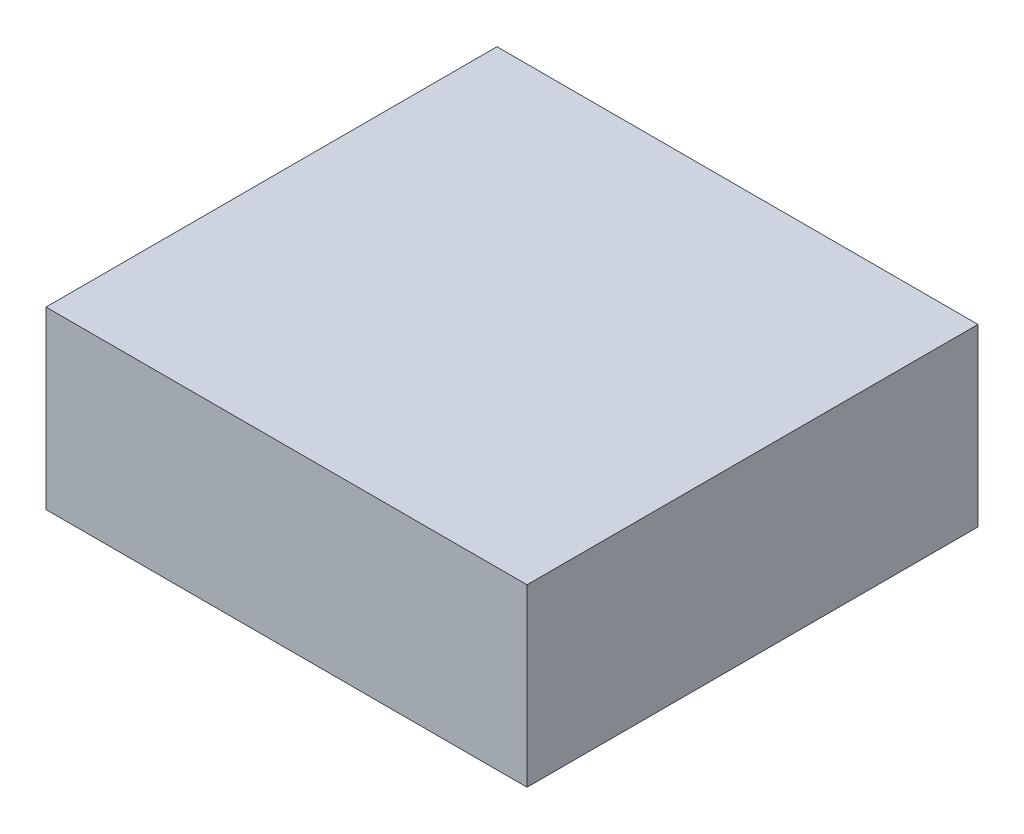
ISO-10303-21;
HEADER;
FILE_DESCRIPTION(('STEP AP214'),'2;1');
FILE_NAME('part.step','',(''),(''),'','','');
FILE_SCHEMA(('AUTOMOTIVE_DESIGN { 1 0 10303 214 1 1 1 1 }'));
ENDSEC;
DATA;
#1=APPLICATION_CONTEXT('core data for automotive mechanical design processes');
#2=APPLICATION_PROTOCOL_DEFINITION('international standard','automotive_design',2000,#1);
#3=PRODUCT_CONTEXT('',#1,'mechanical');
#4=PRODUCT('Part','Part','',(#3));
#5=PRODUCT_RELATED_PRODUCT_CATEGORY('part','',(#4));
#6=PRODUCT_DEFINITION_FORMATION('','',#4);
#7=PRODUCT_DEFINITION_CONTEXT('part definition',#1,'design');
#8=PRODUCT_DEFINITION('design','',#6,#7);
#9=PRODUCT_DEFINITION_SHAPE('','',#8);
#10=(LENGTH_UNIT() NAMED_UNIT(*) SI_UNIT(.MILLI.,.METRE.));
#11=(NAMED_UNIT(*) PLANE_ANGLE_UNIT() SI_UNIT($,.RADIAN.));
#12=(NAMED_UNIT(*) SI_UNIT($,.STERADIAN.) SOLID_ANGLE_UNIT());
#13=UNCERTAINTY_MEASURE_WITH_UNIT(LENGTH_MEASURE(1.E-05),#10,'distance_accuracy_value','');
#14=(GEOMETRIC_REPRESENTATION_CONTEXT(3) GLOBAL_UNCERTAINTY_ASSIGNED_CONTEXT((#13)) GLOBAL_UNIT_ASSIGNED_CONTEXT((#10,
#11,#12)) REPRESENTATION_CONTEXT('',''));
#15=CARTESIAN_POINT('',(0.,0.,0.));
#16=DIRECTION('',(0.,0.,1.));
#17=DIRECTION('',(1.,0.,0.));
#18=AXIS2_PLACEMENT_3D('',#15,#16,#17);
#19=CARTESIAN_POINT('',(-0.47999904,-0.17500092,0.));
#20=DIRECTION('',(0.,1.,0.));
#21=DIRECTION('',(0.,0.,1.));
#22=AXIS2_PLACEMENT_3D('',#19,#20,#21);
#23=PLANE('',#22);
#24=DIRECTION('',(0.,0.,1.));
#25=VECTOR('',#24,1.);
#26=CARTESIAN_POINT('',(0.48000158,-0.17500092,0.));
#27=LINE('',#26,#25);
#28=CARTESIAN_POINT('',(0.48000158,-0.17500092,0.));
#29=VERTEX_POINT('',#28);
#30=CARTESIAN_POINT('',(0.48000158,-0.17500092,0.90000074));
#31=VERTEX_POINT('',#30);
#32=EDGE_CURVE('E19',#29,#31,#27,.T.);
#33=ORIENTED_EDGE('',*,*,#32,.T.);
#34=DIRECTION('',(-1.,0.,0.));
#35=VECTOR('',#34,1.);
#36=CARTESIAN_POINT('',(0.48000158,-0.17500092,0.90000074));
#37=LINE('',#36,#35);
#38=CARTESIAN_POINT('',(-0.47999904,-0.17500092,0.90000074));
#39=VERTEX_POINT('',#38);
#40=EDGE_CURVE('E54',#31,#39,#37,.T.);
#41=ORIENTED_EDGE('',*,*,#40,.T.);
#42=DIRECTION('',(0.,0.,-1.));
#43=VECTOR('',#42,1.);
#44=CARTESIAN_POINT('',(-0.47999904,-0.17500092,0.));
#45=LINE('',#44,#43);
#46=CARTESIAN_POINT('',(-0.47999904,-0.17500092,0.));
#47=VERTEX_POINT('',#46);
#48=EDGE_CURVE('E75',#39,#47,#45,.T.);
#49=ORIENTED_EDGE('',*,*,#48,.T.);
#50=DIRECTION('',(-1.,0.,0.));
#51=VECTOR('',#50,1.);
#52=CARTESIAN_POINT('',(0.48000158,-0.17500092,0.));
#53=LINE('',#52,#51);
#54=EDGE_CURVE('E57',#29,#47,#53,.T.);
#55=ORIENTED_EDGE('',*,*,#54,.F.);
#56=EDGE_LOOP('',(#33,#41,#49,#55));
#57=FACE_BOUND('',#56,.T.);
#58=ADVANCED_FACE('F16',(#57),#23,.F.);
#59=CARTESIAN_POINT('',(0.48000158,-0.17500092,0.));
#60=DIRECTION('',(-1.,0.,0.));
#61=DIRECTION('',(0.,0.,1.));
#62=AXIS2_PLACEMENT_3D('',#59,#60,#61);
#63=PLANE('',#62);
#64=DIRECTION('',(0.,0.,-1.));
#65=VECTOR('',#64,1.);
#66=CARTESIAN_POINT('',(0.48000158,0.17500092,0.));
#67=LINE('',#66,#65);
#68=CARTESIAN_POINT('',(0.48000158,0.17500092,0.));
#69=VERTEX_POINT('',#68);
#70=CARTESIAN_POINT('',(0.48000158,0.17500092,0.90000074));
#71=VERTEX_POINT('',#70);
#72=EDGE_CURVE('E72',#69,#71,#67,.F.);
#73=ORIENTED_EDGE('',*,*,#72,.T.);
#74=DIRECTION('',(0.,1.,0.));
#75=VECTOR('',#74,1.);
#76=CARTESIAN_POINT('',(0.48000158,0.17500092,0.90000074));
#77=LINE('',#76,#75);
#78=EDGE_CURVE('E62',#71,#31,#77,.F.);
#79=ORIENTED_EDGE('',*,*,#78,.T.);
#80=ORIENTED_EDGE('',*,*,#32,.F.);
#81=DIRECTION('',(0.,1.,0.));
#82=VECTOR('',#81,1.);
#83=CARTESIAN_POINT('',(0.48000158,0.17500092,0.));
#84=LINE('',#83,#82);
#85=EDGE_CURVE('E77',#69,#29,#84,.F.);
#86=ORIENTED_EDGE('',*,*,#85,.F.);
#87=EDGE_LOOP('',(#73,#79,#80,#86));
#88=FACE_BOUND('',#87,.T.);
#89=ADVANCED_FACE('F71',(#88),#63,.F.);
#90=CARTESIAN_POINT('',(0.48000158,0.17500092,0.90000074));
#91=DIRECTION('',(0.,0.,-1.));
#92=DIRECTION('',(-1.,0.,0.));
#93=AXIS2_PLACEMENT_3D('',#90,#91,#92);
#94=PLANE('',#93);
#95=DIRECTION('',(0.,1.,0.));
#96=VECTOR('',#95,1.);
#97=CARTESIAN_POINT('',(-0.47999904,0.17500092,0.90000074));
#98=LINE('',#97,#96);
#99=CARTESIAN_POINT('',(-0.47999904,0.17500092,0.90000074));
#100=VERTEX_POINT('',#99);
#101=EDGE_CURVE('E68',#100,#39,#98,.F.);
#102=ORIENTED_EDGE('',*,*,#101,.T.);
#103=ORIENTED_EDGE('',*,*,#40,.F.);
#104=ORIENTED_EDGE('',*,*,#78,.F.);
#105=DIRECTION('',(1.,0.,0.));
#106=VECTOR('',#105,1.);
#107=CARTESIAN_POINT('',(0.48000158,0.17500092,0.90000074));
#108=LINE('',#107,#106);
#109=EDGE_CURVE('E82',#71,#100,#108,.F.);
#110=ORIENTED_EDGE('',*,*,#109,.T.);
#111=EDGE_LOOP('',(#102,#103,#104,#110));
#112=FACE_BOUND('',#111,.T.);
#113=ADVANCED_FACE('F65',(#112),#94,.F.);
#114=CARTESIAN_POINT('',(-0.47999904,0.17500092,0.));
#115=DIRECTION('',(1.,0.,0.));
#116=DIRECTION('',(0.,0.,-1.));
#117=AXIS2_PLACEMENT_3D('',#114,#115,#116);
#118=PLANE('',#117);
#119=ORIENTED_EDGE('',*,*,#48,.F.);
#120=ORIENTED_EDGE('',*,*,#101,.F.);
#121=DIRECTION('',(0.,0.,-1.));
#122=VECTOR('',#121,1.);
#123=CARTESIAN_POINT('',(-0.47999904,0.17500092,0.));
#124=LINE('',#123,#122);
#125=CARTESIAN_POINT('',(-0.47999904,0.17500092,0.));
#126=VERTEX_POINT('',#125);
#127=EDGE_CURVE('E25',#100,#126,#124,.T.);
#128=ORIENTED_EDGE('',*,*,#127,.T.);
#129=DIRECTION('',(0.,1.,0.));
#130=VECTOR('',#129,1.);
#131=CARTESIAN_POINT('',(-0.47999904,0.17500092,0.));
#132=LINE('',#131,#130);
#133=EDGE_CURVE('E33',#47,#126,#132,.T.);
#134=ORIENTED_EDGE('',*,*,#133,.F.);
#135=EDGE_LOOP('',(#119,#120,#128,#134));
#136=FACE_BOUND('',#135,.T.);
#137=ADVANCED_FACE('F87',(#136),#118,.F.);
#138=CARTESIAN_POINT('',(0.48000158,0.17500092,0.));
#139=DIRECTION('',(0.,0.,-1.));
#140=DIRECTION('',(-1.,0.,0.));
#141=AXIS2_PLACEMENT_3D('',#138,#139,#140);
#142=PLANE('',#141);
#143=ORIENTED_EDGE('',*,*,#133,.T.);
#144=DIRECTION('',(1.,0.,0.));
#145=VECTOR('',#144,1.);
#146=CARTESIAN_POINT('',(0.48000158,0.17500092,0.));
#147=LINE('',#146,#145);
#148=EDGE_CURVE('E11',#126,#69,#147,.T.);
#149=ORIENTED_EDGE('',*,*,#148,.T.);
#150=ORIENTED_EDGE('',*,*,#85,.T.);
#151=ORIENTED_EDGE('',*,*,#54,.T.);
#152=EDGE_LOOP('',(#143,#149,#150,#151));
#153=FACE_BOUND('',#152,.T.);
#154=ADVANCED_FACE('F90',(#153),#142,.T.);
#155=CARTESIAN_POINT('',(0.48000158,0.17500092,0.));
#156=DIRECTION('',(0.,-1.,0.));
#157=DIRECTION('',(0.,0.,-1.));
#158=AXIS2_PLACEMENT_3D('',#155,#156,#157);
#159=PLANE('',#158);
#160=ORIENTED_EDGE('',*,*,#127,.F.);
#161=ORIENTED_EDGE('',*,*,#109,.F.);
#162=ORIENTED_EDGE('',*,*,#72,.F.);
#163=ORIENTED_EDGE('',*,*,#148,.F.);
#164=EDGE_LOOP('',(#160,#161,#162,#163));
#165=FACE_BOUND('',#164,.T.);
#166=ADVANCED_FACE('F89',(#165),#159,.F.);
#167=CLOSED_SHELL('',(#58,#89,#113,#137,#154,#166));
#168=MANIFOLD_SOLID_BREP('B1',#167);
#169=ADVANCED_BREP_SHAPE_REPRESENTATION('',(#18,#168),#14);
#170=SHAPE_DEFINITION_REPRESENTATION(#9,#169);
ENDSEC;
END-ISO-10303-21;
